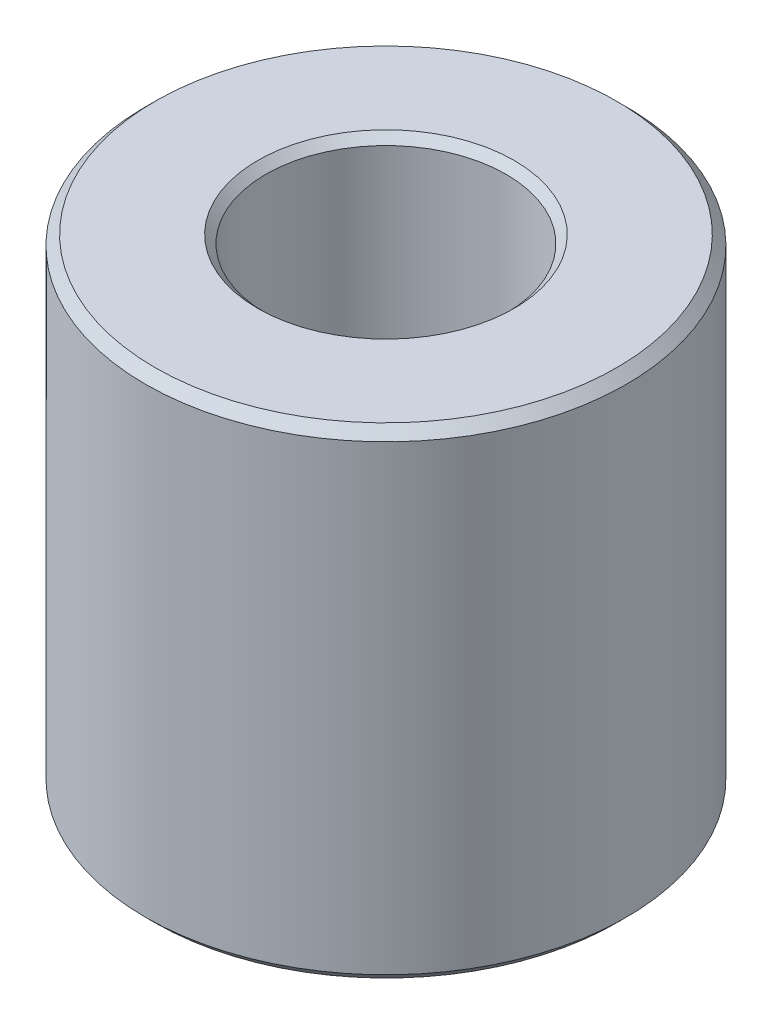
ISO-10303-21;
HEADER;
FILE_DESCRIPTION(('STEP AP214'),'2;1');
FILE_NAME('part.step','',(''),(''),'','','');
FILE_SCHEMA(('AUTOMOTIVE_DESIGN { 1 0 10303 214 1 1 1 1 }'));
ENDSEC;
DATA;
#1=APPLICATION_CONTEXT('core data for automotive mechanical design processes');
#2=APPLICATION_PROTOCOL_DEFINITION('international standard','automotive_design',2000,#1);
#3=PRODUCT_CONTEXT('',#1,'mechanical');
#4=PRODUCT('Part','Part','',(#3));
#5=PRODUCT_RELATED_PRODUCT_CATEGORY('part','',(#4));
#6=PRODUCT_DEFINITION_FORMATION('','',#4);
#7=PRODUCT_DEFINITION_CONTEXT('part definition',#1,'design');
#8=PRODUCT_DEFINITION('design','',#6,#7);
#9=PRODUCT_DEFINITION_SHAPE('','',#8);
#10=(LENGTH_UNIT() NAMED_UNIT(*) SI_UNIT(.MILLI.,.METRE.));
#11=(NAMED_UNIT(*) PLANE_ANGLE_UNIT() SI_UNIT($,.RADIAN.));
#12=(NAMED_UNIT(*) SI_UNIT($,.STERADIAN.) SOLID_ANGLE_UNIT());
#13=UNCERTAINTY_MEASURE_WITH_UNIT(LENGTH_MEASURE(1.E-05),#10,'distance_accuracy_value','');
#14=(GEOMETRIC_REPRESENTATION_CONTEXT(3) GLOBAL_UNCERTAINTY_ASSIGNED_CONTEXT((#13)) GLOBAL_UNIT_ASSIGNED_CONTEXT((#10,
#11,#12)) REPRESENTATION_CONTEXT('',''));
#15=CARTESIAN_POINT('',(0.,0.,0.));
#16=DIRECTION('',(0.,0.,1.));
#17=DIRECTION('',(1.,0.,0.));
#18=AXIS2_PLACEMENT_3D('',#15,#16,#17);
#19=CARTESIAN_POINT('',(0.,38.1,0.));
#20=DIRECTION('',(0.,-1.,0.));
#21=DIRECTION('',(0.,0.,-1.));
#22=AXIS2_PLACEMENT_3D('',#19,#20,#21);
#23=CYLINDRICAL_SURFACE('',#22,19.05);
#24=CARTESIAN_POINT('',(0.,0.76200000000002,0.));
#25=DIRECTION('',(0.,1.,0.));
#26=DIRECTION('',(0.,0.,1.));
#27=AXIS2_PLACEMENT_3D('',#24,#25,#26);
#28=CIRCLE('',#27,19.05);
#29=CARTESIAN_POINT('',(0.,0.76200000000002,19.05));
#30=VERTEX_POINT('',#29);
#31=EDGE_CURVE('E41',#30,#30,#28,.T.);
#32=ORIENTED_EDGE('',*,*,#31,.T.);
#33=EDGE_LOOP('',(#32));
#34=FACE_BOUND('',#33,.T.);
#35=CARTESIAN_POINT('',(0.,37.338,0.));
#36=DIRECTION('',(0.,1.,0.));
#37=DIRECTION('',(0.,0.,1.));
#38=AXIS2_PLACEMENT_3D('',#35,#36,#37);
#39=CIRCLE('',#38,19.05);
#40=CARTESIAN_POINT('',(0.,37.338,19.05));
#41=VERTEX_POINT('',#40);
#42=EDGE_CURVE('E45',#41,#41,#39,.F.);
#43=ORIENTED_EDGE('',*,*,#42,.T.);
#44=EDGE_LOOP('',(#43));
#45=FACE_BOUND('',#44,.T.);
#46=ADVANCED_FACE('F30',(#34,#45),#23,.T.);
#47=CARTESIAN_POINT('',(0.,38.1,0.));
#48=DIRECTION('',(0.,1.,0.));
#49=DIRECTION('',(0.,0.,1.));
#50=AXIS2_PLACEMENT_3D('',#47,#48,#49);
#51=PLANE('',#50);
#52=CARTESIAN_POINT('',(0.,38.1,0.));
#53=DIRECTION('',(0.,1.,0.));
#54=DIRECTION('',(0.,0.,1.));
#55=AXIS2_PLACEMENT_3D('',#52,#53,#54);
#56=CIRCLE('',#55,18.288);
#57=CARTESIAN_POINT('',(0.,38.1,18.288));
#58=VERTEX_POINT('',#57);
#59=EDGE_CURVE('E10',#58,#58,#56,.T.);
#60=ORIENTED_EDGE('',*,*,#59,.T.);
#61=EDGE_LOOP('',(#60));
#62=FACE_BOUND('',#61,.T.);
#63=CARTESIAN_POINT('',(0.,38.1,0.));
#64=DIRECTION('',(0.,1.,0.));
#65=DIRECTION('',(0.,0.,1.));
#66=AXIS2_PLACEMENT_3D('',#63,#64,#65);
#67=CIRCLE('',#66,10.16);
#68=CARTESIAN_POINT('',(0.,38.1,10.16));
#69=VERTEX_POINT('',#68);
#70=EDGE_CURVE('E50',#69,#69,#67,.T.);
#71=ORIENTED_EDGE('',*,*,#70,.F.);
#72=EDGE_LOOP('',(#71));
#73=FACE_BOUND('',#72,.T.);
#74=ADVANCED_FACE('F84',(#62,#73),#51,.T.);
#75=CARTESIAN_POINT('',(0.,0.,0.));
#76=DIRECTION('',(0.,1.,0.));
#77=DIRECTION('',(0.,0.,1.));
#78=AXIS2_PLACEMENT_3D('',#75,#76,#77);
#79=PLANE('',#78);
#80=CARTESIAN_POINT('',(0.,0.,0.));
#81=DIRECTION('',(0.,1.,0.));
#82=DIRECTION('',(0.,0.,1.));
#83=AXIS2_PLACEMENT_3D('',#80,#81,#82);
#84=CIRCLE('',#83,18.288);
#85=CARTESIAN_POINT('',(0.,0.,18.288));
#86=VERTEX_POINT('',#85);
#87=EDGE_CURVE('E37',#86,#86,#84,.F.);
#88=ORIENTED_EDGE('',*,*,#87,.T.);
#89=EDGE_LOOP('',(#88));
#90=FACE_BOUND('',#89,.T.);
#91=CARTESIAN_POINT('',(0.,0.,0.));
#92=DIRECTION('',(0.,1.,0.));
#93=DIRECTION('',(0.,0.,1.));
#94=AXIS2_PLACEMENT_3D('',#91,#92,#93);
#95=CIRCLE('',#94,10.16);
#96=CARTESIAN_POINT('',(0.,0.,10.16));
#97=VERTEX_POINT('',#96);
#98=EDGE_CURVE('E59',#97,#97,#95,.T.);
#99=ORIENTED_EDGE('',*,*,#98,.T.);
#100=EDGE_LOOP('',(#99));
#101=FACE_BOUND('',#100,.T.);
#102=ADVANCED_FACE('F63',(#90,#101),#79,.F.);
#103=CARTESIAN_POINT('',(0.,38.1,0.));
#104=DIRECTION('',(0.,1.,0.));
#105=DIRECTION('',(0.,0.,1.));
#106=AXIS2_PLACEMENT_3D('',#103,#104,#105);
#107=CONICAL_SURFACE('',#106,10.16,0.78539816339745);
#108=CARTESIAN_POINT('',(0.,37.465,0.));
#109=DIRECTION('',(0.,1.,0.));
#110=DIRECTION('',(0.,0.,1.));
#111=AXIS2_PLACEMENT_3D('',#108,#109,#110);
#112=CIRCLE('',#111,9.525);
#113=CARTESIAN_POINT('',(0.,37.465,9.525));
#114=VERTEX_POINT('',#113);
#115=EDGE_CURVE('E53',#114,#114,#112,.T.);
#116=ORIENTED_EDGE('',*,*,#115,.F.);
#117=EDGE_LOOP('',(#116));
#118=FACE_BOUND('',#117,.T.);
#119=ORIENTED_EDGE('',*,*,#70,.T.);
#120=EDGE_LOOP('',(#119));
#121=FACE_BOUND('',#120,.T.);
#122=ADVANCED_FACE('F75',(#118,#121),#107,.F.);
#123=CARTESIAN_POINT('',(0.,38.1,0.));
#124=DIRECTION('',(0.,1.,0.));
#125=DIRECTION('',(0.,0.,1.));
#126=AXIS2_PLACEMENT_3D('',#123,#124,#125);
#127=CYLINDRICAL_SURFACE('',#126,9.52499999999999);
#128=CARTESIAN_POINT('',(0.,0.635000000000011,0.));
#129=DIRECTION('',(0.,1.,0.));
#130=DIRECTION('',(0.,0.,1.));
#131=AXIS2_PLACEMENT_3D('',#128,#129,#130);
#132=CIRCLE('',#131,9.52499999999999);
#133=CARTESIAN_POINT('',(0.,0.635000000000011,9.52499999999999));
#134=VERTEX_POINT('',#133);
#135=EDGE_CURVE('E56',#134,#134,#132,.T.);
#136=ORIENTED_EDGE('',*,*,#135,.F.);
#137=EDGE_LOOP('',(#136));
#138=FACE_BOUND('',#137,.T.);
#139=ORIENTED_EDGE('',*,*,#115,.T.);
#140=EDGE_LOOP('',(#139));
#141=FACE_BOUND('',#140,.T.);
#142=ADVANCED_FACE('F69',(#138,#141),#127,.F.);
#143=CARTESIAN_POINT('',(0.,0.635000000000011,0.));
#144=DIRECTION('',(0.,-1.,0.));
#145=DIRECTION('',(0.,0.,-1.));
#146=AXIS2_PLACEMENT_3D('',#143,#144,#145);
#147=CONICAL_SURFACE('',#146,9.52499999999999,0.785398163397448);
#148=ORIENTED_EDGE('',*,*,#98,.F.);
#149=EDGE_LOOP('',(#148));
#150=FACE_BOUND('',#149,.T.);
#151=ORIENTED_EDGE('',*,*,#135,.T.);
#152=EDGE_LOOP('',(#151));
#153=FACE_BOUND('',#152,.T.);
#154=ADVANCED_FACE('F65',(#150,#153),#147,.F.);
#155=CARTESIAN_POINT('',(0.,0.76200000000002,0.));
#156=DIRECTION('',(0.,1.,0.));
#157=DIRECTION('',(0.,0.,1.));
#158=AXIS2_PLACEMENT_3D('',#155,#156,#157);
#159=CONICAL_SURFACE('',#158,19.05,0.785398163397453);
#160=ORIENTED_EDGE('',*,*,#87,.F.);
#161=EDGE_LOOP('',(#160));
#162=FACE_BOUND('',#161,.T.);
#163=ORIENTED_EDGE('',*,*,#31,.F.);
#164=EDGE_LOOP('',(#163));
#165=FACE_BOUND('',#164,.T.);
#166=ADVANCED_FACE('F68',(#162,#165),#159,.T.);
#167=CARTESIAN_POINT('',(0.,38.1,0.));
#168=DIRECTION('',(0.,-1.,0.));
#169=DIRECTION('',(0.,0.,-1.));
#170=AXIS2_PLACEMENT_3D('',#167,#168,#169);
#171=CONICAL_SURFACE('',#170,18.288,0.785398163397444);
#172=ORIENTED_EDGE('',*,*,#42,.F.);
#173=EDGE_LOOP('',(#172));
#174=FACE_BOUND('',#173,.T.);
#175=ORIENTED_EDGE('',*,*,#59,.F.);
#176=EDGE_LOOP('',(#175));
#177=FACE_BOUND('',#176,.T.);
#178=ADVANCED_FACE('F32',(#174,#177),#171,.T.);
#179=CLOSED_SHELL('',(#46,#74,#102,#122,#142,#154,#166,#178));
#180=MANIFOLD_SOLID_BREP('B2',#179);
#181=ADVANCED_BREP_SHAPE_REPRESENTATION('',(#18,#180),#14);
#182=SHAPE_DEFINITION_REPRESENTATION(#9,#181);
ENDSEC;
END-ISO-10303-21;
